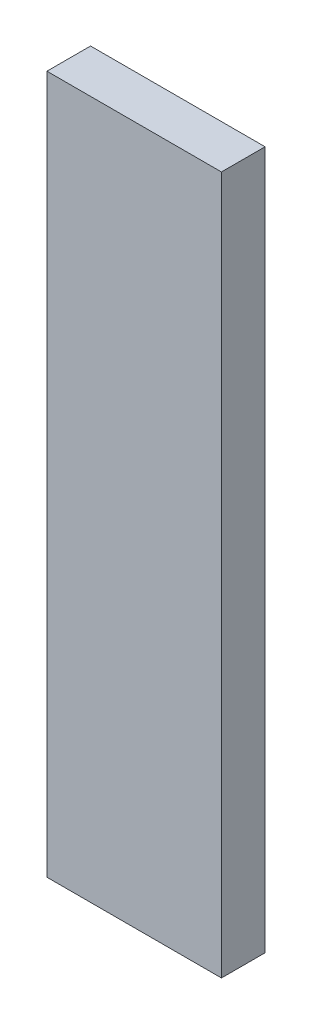
ISO-10303-21;
HEADER;
FILE_DESCRIPTION(('STEP AP214'),'2;1');
FILE_NAME('part.step','',(''),(''),'','','');
FILE_SCHEMA(('AUTOMOTIVE_DESIGN { 1 0 10303 214 1 1 1 1 }'));
ENDSEC;
DATA;
#1=APPLICATION_CONTEXT('core data for automotive mechanical design processes');
#2=APPLICATION_PROTOCOL_DEFINITION('international standard','automotive_design',2000,#1);
#3=PRODUCT_CONTEXT('',#1,'mechanical');
#4=PRODUCT('Part','Part','',(#3));
#5=PRODUCT_RELATED_PRODUCT_CATEGORY('part','',(#4));
#6=PRODUCT_DEFINITION_FORMATION('','',#4);
#7=PRODUCT_DEFINITION_CONTEXT('part definition',#1,'design');
#8=PRODUCT_DEFINITION('design','',#6,#7);
#9=PRODUCT_DEFINITION_SHAPE('','',#8);
#10=(LENGTH_UNIT() NAMED_UNIT(*) SI_UNIT(.MILLI.,.METRE.));
#11=(NAMED_UNIT(*) PLANE_ANGLE_UNIT() SI_UNIT($,.RADIAN.));
#12=(NAMED_UNIT(*) SI_UNIT($,.STERADIAN.) SOLID_ANGLE_UNIT());
#13=UNCERTAINTY_MEASURE_WITH_UNIT(LENGTH_MEASURE(1.E-05),#10,'distance_accuracy_value','');
#14=(GEOMETRIC_REPRESENTATION_CONTEXT(3) GLOBAL_UNCERTAINTY_ASSIGNED_CONTEXT((#13)) GLOBAL_UNIT_ASSIGNED_CONTEXT((#10,
#11,#12)) REPRESENTATION_CONTEXT('',''));
#15=CARTESIAN_POINT('',(0.,0.,0.));
#16=DIRECTION('',(0.,0.,1.));
#17=DIRECTION('',(1.,0.,0.));
#18=AXIS2_PLACEMENT_3D('',#15,#16,#17);
#19=CARTESIAN_POINT('',(0.,101.6,0.));
#20=DIRECTION('',(1.,0.,0.));
#21=DIRECTION('',(0.,0.,-1.));
#22=AXIS2_PLACEMENT_3D('',#19,#20,#21);
#23=PLANE('',#22);
#24=DIRECTION('',(0.,0.,1.));
#25=VECTOR('',#24,1.);
#26=CARTESIAN_POINT('',(0.,0.,0.));
#27=LINE('',#26,#25);
#28=CARTESIAN_POINT('',(0.,0.,-6.35));
#29=VERTEX_POINT('',#28);
#30=CARTESIAN_POINT('',(0.,0.,0.));
#31=VERTEX_POINT('',#30);
#32=EDGE_CURVE('E107',#29,#31,#27,.T.);
#33=ORIENTED_EDGE('',*,*,#32,.T.);
#34=DIRECTION('',(0.,-1.,0.));
#35=VECTOR('',#34,1.);
#36=CARTESIAN_POINT('',(0.,101.6,0.));
#37=LINE('',#36,#35);
#38=CARTESIAN_POINT('',(0.,101.6,0.));
#39=VERTEX_POINT('',#38);
#40=EDGE_CURVE('E11',#39,#31,#37,.T.);
#41=ORIENTED_EDGE('',*,*,#40,.F.);
#42=DIRECTION('',(0.,0.,1.));
#43=VECTOR('',#42,1.);
#44=CARTESIAN_POINT('',(0.,101.6,0.));
#45=LINE('',#44,#43);
#46=CARTESIAN_POINT('',(0.,101.6,-6.35));
#47=VERTEX_POINT('',#46);
#48=EDGE_CURVE('E91',#47,#39,#45,.T.);
#49=ORIENTED_EDGE('',*,*,#48,.F.);
#50=DIRECTION('',(0.,-1.,0.));
#51=VECTOR('',#50,1.);
#52=CARTESIAN_POINT('',(0.,101.6,-6.35));
#53=LINE('',#52,#51);
#54=EDGE_CURVE('E103',#47,#29,#53,.T.);
#55=ORIENTED_EDGE('',*,*,#54,.T.);
#56=EDGE_LOOP('',(#33,#41,#49,#55));
#57=FACE_BOUND('',#56,.T.);
#58=ADVANCED_FACE('F39',(#57),#23,.F.);
#59=CARTESIAN_POINT('',(0.,101.6,0.));
#60=DIRECTION('',(0.,0.,-1.));
#61=DIRECTION('',(-1.,0.,0.));
#62=AXIS2_PLACEMENT_3D('',#59,#60,#61);
#63=PLANE('',#62);
#64=DIRECTION('',(1.,0.,0.));
#65=VECTOR('',#64,1.);
#66=CARTESIAN_POINT('',(0.,0.,0.));
#67=LINE('',#66,#65);
#68=CARTESIAN_POINT('',(25.4,0.,0.));
#69=VERTEX_POINT('',#68);
#70=EDGE_CURVE('E96',#31,#69,#67,.T.);
#71=ORIENTED_EDGE('',*,*,#70,.T.);
#72=DIRECTION('',(0.,-1.,0.));
#73=VECTOR('',#72,1.);
#74=CARTESIAN_POINT('',(25.4,101.6,0.));
#75=LINE('',#74,#73);
#76=CARTESIAN_POINT('',(25.4,101.6,0.));
#77=VERTEX_POINT('',#76);
#78=EDGE_CURVE('E48',#77,#69,#75,.T.);
#79=ORIENTED_EDGE('',*,*,#78,.F.);
#80=DIRECTION('',(1.,0.,0.));
#81=VECTOR('',#80,1.);
#82=CARTESIAN_POINT('',(0.,101.6,0.));
#83=LINE('',#82,#81);
#84=EDGE_CURVE('E86',#39,#77,#83,.T.);
#85=ORIENTED_EDGE('',*,*,#84,.F.);
#86=ORIENTED_EDGE('',*,*,#40,.T.);
#87=EDGE_LOOP('',(#71,#79,#85,#86));
#88=FACE_BOUND('',#87,.T.);
#89=ADVANCED_FACE('F95',(#88),#63,.F.);
#90=CARTESIAN_POINT('',(25.4,101.6,0.));
#91=DIRECTION('',(-1.,0.,0.));
#92=DIRECTION('',(0.,0.,1.));
#93=AXIS2_PLACEMENT_3D('',#90,#91,#92);
#94=PLANE('',#93);
#95=DIRECTION('',(0.,0.,-1.));
#96=VECTOR('',#95,1.);
#97=CARTESIAN_POINT('',(25.4,0.,0.));
#98=LINE('',#97,#96);
#99=CARTESIAN_POINT('',(25.4,0.,-6.35));
#100=VERTEX_POINT('',#99);
#101=EDGE_CURVE('E73',#69,#100,#98,.T.);
#102=ORIENTED_EDGE('',*,*,#101,.T.);
#103=DIRECTION('',(0.,-1.,0.));
#104=VECTOR('',#103,1.);
#105=CARTESIAN_POINT('',(25.4,101.6,-6.35));
#106=LINE('',#105,#104);
#107=CARTESIAN_POINT('',(25.4,101.6,-6.35));
#108=VERTEX_POINT('',#107);
#109=EDGE_CURVE('E98',#108,#100,#106,.T.);
#110=ORIENTED_EDGE('',*,*,#109,.F.);
#111=DIRECTION('',(0.,0.,-1.));
#112=VECTOR('',#111,1.);
#113=CARTESIAN_POINT('',(25.4,101.6,0.));
#114=LINE('',#113,#112);
#115=EDGE_CURVE('E89',#77,#108,#114,.T.);
#116=ORIENTED_EDGE('',*,*,#115,.F.);
#117=ORIENTED_EDGE('',*,*,#78,.T.);
#118=EDGE_LOOP('',(#102,#110,#116,#117));
#119=FACE_BOUND('',#118,.T.);
#120=ADVANCED_FACE('F99',(#119),#94,.F.);
#121=CARTESIAN_POINT('',(0.,101.6,-6.35));
#122=DIRECTION('',(0.,0.,1.));
#123=DIRECTION('',(1.,0.,0.));
#124=AXIS2_PLACEMENT_3D('',#121,#122,#123);
#125=PLANE('',#124);
#126=DIRECTION('',(-1.,0.,0.));
#127=VECTOR('',#126,1.);
#128=CARTESIAN_POINT('',(0.,0.,-6.35));
#129=LINE('',#128,#127);
#130=EDGE_CURVE('E79',#100,#29,#129,.T.);
#131=ORIENTED_EDGE('',*,*,#130,.T.);
#132=ORIENTED_EDGE('',*,*,#54,.F.);
#133=DIRECTION('',(-1.,0.,0.));
#134=VECTOR('',#133,1.);
#135=CARTESIAN_POINT('',(0.,101.6,-6.35));
#136=LINE('',#135,#134);
#137=EDGE_CURVE('E56',#108,#47,#136,.T.);
#138=ORIENTED_EDGE('',*,*,#137,.F.);
#139=ORIENTED_EDGE('',*,*,#109,.T.);
#140=EDGE_LOOP('',(#131,#132,#138,#139));
#141=FACE_BOUND('',#140,.T.);
#142=ADVANCED_FACE('F120',(#141),#125,.F.);
#143=CARTESIAN_POINT('',(0.,101.6,0.));
#144=DIRECTION('',(0.,-1.,0.));
#145=DIRECTION('',(0.,0.,-1.));
#146=AXIS2_PLACEMENT_3D('',#143,#144,#145);
#147=PLANE('',#146);
#148=ORIENTED_EDGE('',*,*,#48,.T.);
#149=ORIENTED_EDGE('',*,*,#84,.T.);
#150=ORIENTED_EDGE('',*,*,#115,.T.);
#151=ORIENTED_EDGE('',*,*,#137,.T.);
#152=EDGE_LOOP('',(#148,#149,#150,#151));
#153=FACE_BOUND('',#152,.T.);
#154=ADVANCED_FACE('F87',(#153),#147,.F.);
#155=CARTESIAN_POINT('',(0.,0.,0.));
#156=DIRECTION('',(0.,-1.,0.));
#157=DIRECTION('',(0.,0.,-1.));
#158=AXIS2_PLACEMENT_3D('',#155,#156,#157);
#159=PLANE('',#158);
#160=ORIENTED_EDGE('',*,*,#32,.F.);
#161=ORIENTED_EDGE('',*,*,#130,.F.);
#162=ORIENTED_EDGE('',*,*,#101,.F.);
#163=ORIENTED_EDGE('',*,*,#70,.F.);
#164=EDGE_LOOP('',(#160,#161,#162,#163));
#165=FACE_BOUND('',#164,.T.);
#166=ADVANCED_FACE('F123',(#165),#159,.T.);
#167=CLOSED_SHELL('',(#58,#89,#120,#142,#154,#166));
#168=MANIFOLD_SOLID_BREP('B2',#167);
#169=ADVANCED_BREP_SHAPE_REPRESENTATION('',(#18,#168),#14);
#170=SHAPE_DEFINITION_REPRESENTATION(#9,#169);
ENDSEC;
END-ISO-10303-21;
